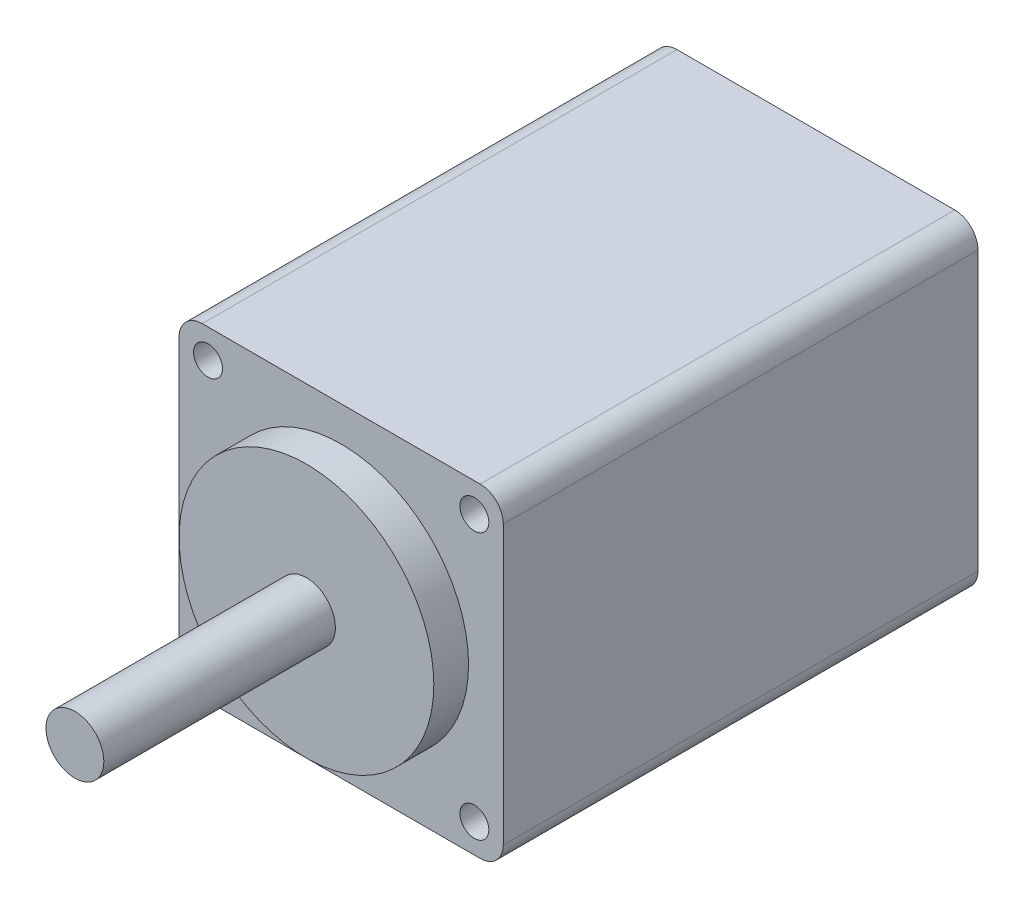
ISO-10303-21;
HEADER;
FILE_DESCRIPTION(('STEP AP214'),'2;1');
FILE_NAME('part.step','',(''),(''),'','','');
FILE_SCHEMA(('AUTOMOTIVE_DESIGN { 1 0 10303 214 1 1 1 1 }'));
ENDSEC;
DATA;
#1=APPLICATION_CONTEXT('core data for automotive mechanical design processes');
#2=APPLICATION_PROTOCOL_DEFINITION('international standard','automotive_design',2000,#1);
#3=PRODUCT_CONTEXT('',#1,'mechanical');
#4=PRODUCT('Part','Part','',(#3));
#5=PRODUCT_RELATED_PRODUCT_CATEGORY('part','',(#4));
#6=PRODUCT_DEFINITION_FORMATION('','',#4);
#7=PRODUCT_DEFINITION_CONTEXT('part definition',#1,'design');
#8=PRODUCT_DEFINITION('design','',#6,#7);
#9=PRODUCT_DEFINITION_SHAPE('','',#8);
#10=(LENGTH_UNIT() NAMED_UNIT(*) SI_UNIT(.MILLI.,.METRE.));
#11=(NAMED_UNIT(*) PLANE_ANGLE_UNIT() SI_UNIT($,.RADIAN.));
#12=(NAMED_UNIT(*) SI_UNIT($,.STERADIAN.) SOLID_ANGLE_UNIT());
#13=UNCERTAINTY_MEASURE_WITH_UNIT(LENGTH_MEASURE(1.E-05),#10,'distance_accuracy_value','');
#14=(GEOMETRIC_REPRESENTATION_CONTEXT(3) GLOBAL_UNCERTAINTY_ASSIGNED_CONTEXT((#13)) GLOBAL_UNIT_ASSIGNED_CONTEXT((#10,
#11,#12)) REPRESENTATION_CONTEXT('',''));
#15=CARTESIAN_POINT('',(0.,0.,0.));
#16=DIRECTION('',(0.,0.,1.));
#17=DIRECTION('',(1.,0.,0.));
#18=AXIS2_PLACEMENT_3D('',#15,#16,#17);
#19=CARTESIAN_POINT('',(0.,0.,41.));
#20=DIRECTION('',(0.,0.,1.));
#21=DIRECTION('',(1.,0.,0.));
#22=AXIS2_PLACEMENT_3D('',#19,#20,#21);
#23=PLANE('',#22);
#24=CARTESIAN_POINT('',(0.,0.,41.));
#25=DIRECTION('',(0.,0.,1.));
#26=DIRECTION('',(1.,0.,0.));
#27=AXIS2_PLACEMENT_3D('',#24,#25,#26);
#28=CIRCLE('',#27,11.);
#29=CARTESIAN_POINT('',(11.,0.,41.));
#30=VERTEX_POINT('',#29);
#31=EDGE_CURVE('E203',#30,#30,#28,.T.);
#32=ORIENTED_EDGE('',*,*,#31,.F.);
#33=EDGE_LOOP('',(#32));
#34=FACE_BOUND('',#33,.T.);
#35=CARTESIAN_POINT('',(11.5,-11.5,41.));
#36=DIRECTION('',(0.,0.,1.));
#37=DIRECTION('',(1.,0.,0.));
#38=AXIS2_PLACEMENT_3D('',#35,#36,#37);
#39=CIRCLE('',#38,1.25);
#40=CARTESIAN_POINT('',(12.75,-11.5,41.));
#41=VERTEX_POINT('',#40);
#42=EDGE_CURVE('E188',#41,#41,#39,.T.);
#43=ORIENTED_EDGE('',*,*,#42,.F.);
#44=EDGE_LOOP('',(#43));
#45=FACE_BOUND('',#44,.T.);
#46=CARTESIAN_POINT('',(-11.5,11.5,41.));
#47=DIRECTION('',(0.,0.,1.));
#48=DIRECTION('',(1.,0.,0.));
#49=AXIS2_PLACEMENT_3D('',#46,#47,#48);
#50=CIRCLE('',#49,1.25);
#51=CARTESIAN_POINT('',(-10.25,11.5,41.));
#52=VERTEX_POINT('',#51);
#53=EDGE_CURVE('E171',#52,#52,#50,.T.);
#54=ORIENTED_EDGE('',*,*,#53,.F.);
#55=EDGE_LOOP('',(#54));
#56=FACE_BOUND('',#55,.T.);
#57=DIRECTION('',(0.,-1.,0.));
#58=VECTOR('',#57,1.);
#59=CARTESIAN_POINT('',(-14.,14.,41.));
#60=LINE('',#59,#58);
#61=CARTESIAN_POINT('',(-14.,12.,41.));
#62=VERTEX_POINT('',#61);
#63=CARTESIAN_POINT('',(-14.,-12.,41.));
#64=VERTEX_POINT('',#63);
#65=EDGE_CURVE('E178',#62,#64,#60,.T.);
#66=ORIENTED_EDGE('',*,*,#65,.T.);
#67=CARTESIAN_POINT('',(-12.,-12.,41.));
#68=DIRECTION('',(0.,0.,1.));
#69=DIRECTION('',(1.,0.,0.));
#70=AXIS2_PLACEMENT_3D('',#67,#68,#69);
#71=CIRCLE('',#70,2.);
#72=CARTESIAN_POINT('',(-12.,-14.,41.));
#73=VERTEX_POINT('',#72);
#74=EDGE_CURVE('E155',#64,#73,#71,.T.);
#75=ORIENTED_EDGE('',*,*,#74,.T.);
#76=DIRECTION('',(1.,0.,0.));
#77=VECTOR('',#76,1.);
#78=CARTESIAN_POINT('',(-14.,-14.,41.));
#79=LINE('',#78,#77);
#80=CARTESIAN_POINT('',(12.,-14.,41.));
#81=VERTEX_POINT('',#80);
#82=EDGE_CURVE('E125',#73,#81,#79,.T.);
#83=ORIENTED_EDGE('',*,*,#82,.T.);
#84=CARTESIAN_POINT('',(12.,-12.,41.));
#85=DIRECTION('',(0.,0.,1.));
#86=DIRECTION('',(1.,0.,0.));
#87=AXIS2_PLACEMENT_3D('',#84,#85,#86);
#88=CIRCLE('',#87,2.);
#89=CARTESIAN_POINT('',(14.,-12.,41.));
#90=VERTEX_POINT('',#89);
#91=EDGE_CURVE('E153',#81,#90,#88,.T.);
#92=ORIENTED_EDGE('',*,*,#91,.T.);
#93=DIRECTION('',(0.,1.,0.));
#94=VECTOR('',#93,1.);
#95=CARTESIAN_POINT('',(14.,14.,41.));
#96=LINE('',#95,#94);
#97=CARTESIAN_POINT('',(14.,12.,41.));
#98=VERTEX_POINT('',#97);
#99=EDGE_CURVE('E132',#90,#98,#96,.T.);
#100=ORIENTED_EDGE('',*,*,#99,.T.);
#101=CARTESIAN_POINT('',(12.,12.,41.));
#102=DIRECTION('',(0.,0.,1.));
#103=DIRECTION('',(1.,0.,0.));
#104=AXIS2_PLACEMENT_3D('',#101,#102,#103);
#105=CIRCLE('',#104,2.);
#106=CARTESIAN_POINT('',(12.,14.,41.));
#107=VERTEX_POINT('',#106);
#108=EDGE_CURVE('E60',#98,#107,#105,.T.);
#109=ORIENTED_EDGE('',*,*,#108,.T.);
#110=DIRECTION('',(-1.,0.,0.));
#111=VECTOR('',#110,1.);
#112=CARTESIAN_POINT('',(-14.,14.,41.));
#113=LINE('',#112,#111);
#114=CARTESIAN_POINT('',(-12.,14.,41.));
#115=VERTEX_POINT('',#114);
#116=EDGE_CURVE('E135',#107,#115,#113,.T.);
#117=ORIENTED_EDGE('',*,*,#116,.T.);
#118=CARTESIAN_POINT('',(-12.,12.,41.));
#119=DIRECTION('',(0.,0.,1.));
#120=DIRECTION('',(1.,0.,0.));
#121=AXIS2_PLACEMENT_3D('',#118,#119,#120);
#122=CIRCLE('',#121,2.);
#123=EDGE_CURVE('E150',#115,#62,#122,.T.);
#124=ORIENTED_EDGE('',*,*,#123,.T.);
#125=EDGE_LOOP('',(#66,#75,#83,#92,#100,#109,#117,#124));
#126=FACE_BOUND('',#125,.T.);
#127=CARTESIAN_POINT('',(11.5,11.5,41.));
#128=DIRECTION('',(0.,0.,1.));
#129=DIRECTION('',(-1.,0.,0.));
#130=AXIS2_PLACEMENT_3D('',#127,#128,#129);
#131=CIRCLE('',#130,1.25);
#132=CARTESIAN_POINT('',(10.25,11.5,41.));
#133=VERTEX_POINT('',#132);
#134=EDGE_CURVE('E183',#133,#133,#131,.T.);
#135=ORIENTED_EDGE('',*,*,#134,.F.);
#136=EDGE_LOOP('',(#135));
#137=FACE_BOUND('',#136,.T.);
#138=CARTESIAN_POINT('',(-11.5,-11.5,41.));
#139=DIRECTION('',(0.,0.,1.));
#140=DIRECTION('',(-1.,0.,0.));
#141=AXIS2_PLACEMENT_3D('',#138,#139,#140);
#142=CIRCLE('',#141,1.25);
#143=CARTESIAN_POINT('',(-12.75,-11.5,41.));
#144=VERTEX_POINT('',#143);
#145=EDGE_CURVE('E194',#144,#144,#142,.T.);
#146=ORIENTED_EDGE('',*,*,#145,.F.);
#147=EDGE_LOOP('',(#146));
#148=FACE_BOUND('',#147,.T.);
#149=ADVANCED_FACE('F39',(#34,#45,#56,#126,#137,#148),#23,.T.);
#150=CARTESIAN_POINT('',(0.,0.,0.));
#151=DIRECTION('',(0.,0.,1.));
#152=DIRECTION('',(1.,0.,0.));
#153=AXIS2_PLACEMENT_3D('',#150,#151,#152);
#154=PLANE('',#153);
#155=DIRECTION('',(1.,0.,0.));
#156=VECTOR('',#155,1.);
#157=CARTESIAN_POINT('',(-14.,-14.,0.));
#158=LINE('',#157,#156);
#159=CARTESIAN_POINT('',(-12.,-14.,0.));
#160=VERTEX_POINT('',#159);
#161=CARTESIAN_POINT('',(12.,-14.,0.));
#162=VERTEX_POINT('',#161);
#163=EDGE_CURVE('E122',#160,#162,#158,.T.);
#164=ORIENTED_EDGE('',*,*,#163,.F.);
#165=CARTESIAN_POINT('',(-12.,-12.,0.));
#166=DIRECTION('',(0.,0.,1.));
#167=DIRECTION('',(1.,0.,0.));
#168=AXIS2_PLACEMENT_3D('',#165,#166,#167);
#169=CIRCLE('',#168,2.);
#170=CARTESIAN_POINT('',(-14.,-12.,0.));
#171=VERTEX_POINT('',#170);
#172=EDGE_CURVE('E105',#160,#171,#169,.F.);
#173=ORIENTED_EDGE('',*,*,#172,.T.);
#174=DIRECTION('',(0.,-1.,0.));
#175=VECTOR('',#174,1.);
#176=CARTESIAN_POINT('',(-14.,14.,0.));
#177=LINE('',#176,#175);
#178=CARTESIAN_POINT('',(-14.,12.,0.));
#179=VERTEX_POINT('',#178);
#180=EDGE_CURVE('E133',#179,#171,#177,.T.);
#181=ORIENTED_EDGE('',*,*,#180,.F.);
#182=CARTESIAN_POINT('',(-12.,12.,0.));
#183=DIRECTION('',(0.,0.,1.));
#184=DIRECTION('',(1.,0.,0.));
#185=AXIS2_PLACEMENT_3D('',#182,#183,#184);
#186=CIRCLE('',#185,2.);
#187=CARTESIAN_POINT('',(-12.,14.,0.));
#188=VERTEX_POINT('',#187);
#189=EDGE_CURVE('E126',#179,#188,#186,.F.);
#190=ORIENTED_EDGE('',*,*,#189,.T.);
#191=DIRECTION('',(-1.,0.,0.));
#192=VECTOR('',#191,1.);
#193=CARTESIAN_POINT('',(-14.,14.,0.));
#194=LINE('',#193,#192);
#195=CARTESIAN_POINT('',(12.,14.,0.));
#196=VERTEX_POINT('',#195);
#197=EDGE_CURVE('E137',#196,#188,#194,.T.);
#198=ORIENTED_EDGE('',*,*,#197,.F.);
#199=CARTESIAN_POINT('',(12.,12.,0.));
#200=DIRECTION('',(0.,0.,1.));
#201=DIRECTION('',(1.,0.,0.));
#202=AXIS2_PLACEMENT_3D('',#199,#200,#201);
#203=CIRCLE('',#202,2.);
#204=CARTESIAN_POINT('',(14.,12.,0.));
#205=VERTEX_POINT('',#204);
#206=EDGE_CURVE('E144',#196,#205,#203,.F.);
#207=ORIENTED_EDGE('',*,*,#206,.T.);
#208=DIRECTION('',(0.,1.,0.));
#209=VECTOR('',#208,1.);
#210=CARTESIAN_POINT('',(14.,14.,0.));
#211=LINE('',#210,#209);
#212=CARTESIAN_POINT('',(14.,-12.,0.));
#213=VERTEX_POINT('',#212);
#214=EDGE_CURVE('E166',#213,#205,#211,.T.);
#215=ORIENTED_EDGE('',*,*,#214,.F.);
#216=CARTESIAN_POINT('',(12.,-12.,0.));
#217=DIRECTION('',(0.,0.,1.));
#218=DIRECTION('',(1.,0.,0.));
#219=AXIS2_PLACEMENT_3D('',#216,#217,#218);
#220=CIRCLE('',#219,2.);
#221=EDGE_CURVE('E116',#213,#162,#220,.F.);
#222=ORIENTED_EDGE('',*,*,#221,.T.);
#223=EDGE_LOOP('',(#164,#173,#181,#190,#198,#207,#215,#222));
#224=FACE_BOUND('',#223,.T.);
#225=CARTESIAN_POINT('',(-11.5,11.5,0.));
#226=DIRECTION('',(0.,0.,1.));
#227=DIRECTION('',(1.,0.,0.));
#228=AXIS2_PLACEMENT_3D('',#225,#226,#227);
#229=CIRCLE('',#228,1.25);
#230=CARTESIAN_POINT('',(-10.25,11.5,0.));
#231=VERTEX_POINT('',#230);
#232=EDGE_CURVE('E174',#231,#231,#229,.T.);
#233=ORIENTED_EDGE('',*,*,#232,.T.);
#234=EDGE_LOOP('',(#233));
#235=FACE_BOUND('',#234,.T.);
#236=CARTESIAN_POINT('',(11.5,11.5,0.));
#237=DIRECTION('',(0.,0.,1.));
#238=DIRECTION('',(-1.,0.,0.));
#239=AXIS2_PLACEMENT_3D('',#236,#237,#238);
#240=CIRCLE('',#239,1.25);
#241=CARTESIAN_POINT('',(10.25,11.5,0.));
#242=VERTEX_POINT('',#241);
#243=EDGE_CURVE('E185',#242,#242,#240,.T.);
#244=ORIENTED_EDGE('',*,*,#243,.T.);
#245=EDGE_LOOP('',(#244));
#246=FACE_BOUND('',#245,.T.);
#247=CARTESIAN_POINT('',(11.5,-11.5,0.));
#248=DIRECTION('',(0.,0.,1.));
#249=DIRECTION('',(1.,0.,0.));
#250=AXIS2_PLACEMENT_3D('',#247,#248,#249);
#251=CIRCLE('',#250,1.25);
#252=CARTESIAN_POINT('',(12.75,-11.5,0.));
#253=VERTEX_POINT('',#252);
#254=EDGE_CURVE('E191',#253,#253,#251,.T.);
#255=ORIENTED_EDGE('',*,*,#254,.T.);
#256=EDGE_LOOP('',(#255));
#257=FACE_BOUND('',#256,.T.);
#258=CARTESIAN_POINT('',(-11.5,-11.5,0.));
#259=DIRECTION('',(0.,0.,1.));
#260=DIRECTION('',(-1.,0.,0.));
#261=AXIS2_PLACEMENT_3D('',#258,#259,#260);
#262=CIRCLE('',#261,1.25);
#263=CARTESIAN_POINT('',(-12.75,-11.5,0.));
#264=VERTEX_POINT('',#263);
#265=EDGE_CURVE('E197',#264,#264,#262,.T.);
#266=ORIENTED_EDGE('',*,*,#265,.T.);
#267=EDGE_LOOP('',(#266));
#268=FACE_BOUND('',#267,.T.);
#269=ADVANCED_FACE('F129',(#224,#235,#246,#257,#268),#154,.F.);
#270=CARTESIAN_POINT('',(14.,14.,41.));
#271=DIRECTION('',(-1.,0.,0.));
#272=DIRECTION('',(0.,0.,1.));
#273=AXIS2_PLACEMENT_3D('',#270,#271,#272);
#274=PLANE('',#273);
#275=ORIENTED_EDGE('',*,*,#99,.F.);
#276=DIRECTION('',(0.,0.,-1.));
#277=VECTOR('',#276,1.);
#278=CARTESIAN_POINT('',(14.,-12.,41.));
#279=LINE('',#278,#277);
#280=EDGE_CURVE('E159',#90,#213,#279,.T.);
#281=ORIENTED_EDGE('',*,*,#280,.T.);
#282=ORIENTED_EDGE('',*,*,#214,.T.);
#283=DIRECTION('',(0.,0.,-1.));
#284=VECTOR('',#283,1.);
#285=CARTESIAN_POINT('',(14.,12.,41.));
#286=LINE('',#285,#284);
#287=EDGE_CURVE('E157',#205,#98,#286,.F.);
#288=ORIENTED_EDGE('',*,*,#287,.T.);
#289=EDGE_LOOP('',(#275,#281,#282,#288));
#290=FACE_BOUND('',#289,.T.);
#291=ADVANCED_FACE('F165',(#290),#274,.F.);
#292=CARTESIAN_POINT('',(-14.,14.,41.));
#293=DIRECTION('',(0.,-1.,0.));
#294=DIRECTION('',(0.,0.,-1.));
#295=AXIS2_PLACEMENT_3D('',#292,#293,#294);
#296=PLANE('',#295);
#297=ORIENTED_EDGE('',*,*,#116,.F.);
#298=DIRECTION('',(0.,0.,-1.));
#299=VECTOR('',#298,1.);
#300=CARTESIAN_POINT('',(12.,14.,41.));
#301=LINE('',#300,#299);
#302=EDGE_CURVE('E11',#107,#196,#301,.T.);
#303=ORIENTED_EDGE('',*,*,#302,.T.);
#304=ORIENTED_EDGE('',*,*,#197,.T.);
#305=DIRECTION('',(0.,0.,-1.));
#306=VECTOR('',#305,1.);
#307=CARTESIAN_POINT('',(-12.,14.,41.));
#308=LINE('',#307,#306);
#309=EDGE_CURVE('E47',#188,#115,#308,.F.);
#310=ORIENTED_EDGE('',*,*,#309,.T.);
#311=EDGE_LOOP('',(#297,#303,#304,#310));
#312=FACE_BOUND('',#311,.T.);
#313=ADVANCED_FACE('F258',(#312),#296,.F.);
#314=CARTESIAN_POINT('',(-14.,14.,41.));
#315=DIRECTION('',(1.,0.,0.));
#316=DIRECTION('',(0.,0.,-1.));
#317=AXIS2_PLACEMENT_3D('',#314,#315,#316);
#318=PLANE('',#317);
#319=ORIENTED_EDGE('',*,*,#180,.T.);
#320=DIRECTION('',(0.,0.,-1.));
#321=VECTOR('',#320,1.);
#322=CARTESIAN_POINT('',(-14.,-12.,41.));
#323=LINE('',#322,#321);
#324=EDGE_CURVE('E110',#171,#64,#323,.F.);
#325=ORIENTED_EDGE('',*,*,#324,.T.);
#326=ORIENTED_EDGE('',*,*,#65,.F.);
#327=DIRECTION('',(0.,0.,-1.));
#328=VECTOR('',#327,1.);
#329=CARTESIAN_POINT('',(-14.,12.,41.));
#330=LINE('',#329,#328);
#331=EDGE_CURVE('E115',#62,#179,#330,.T.);
#332=ORIENTED_EDGE('',*,*,#331,.T.);
#333=EDGE_LOOP('',(#319,#325,#326,#332));
#334=FACE_BOUND('',#333,.T.);
#335=ADVANCED_FACE('F265',(#334),#318,.F.);
#336=CARTESIAN_POINT('',(-14.,-14.,41.));
#337=DIRECTION('',(0.,1.,0.));
#338=DIRECTION('',(0.,0.,1.));
#339=AXIS2_PLACEMENT_3D('',#336,#337,#338);
#340=PLANE('',#339);
#341=ORIENTED_EDGE('',*,*,#82,.F.);
#342=DIRECTION('',(0.,0.,-1.));
#343=VECTOR('',#342,1.);
#344=CARTESIAN_POINT('',(-12.,-14.,41.));
#345=LINE('',#344,#343);
#346=EDGE_CURVE('E109',#73,#160,#345,.T.);
#347=ORIENTED_EDGE('',*,*,#346,.T.);
#348=ORIENTED_EDGE('',*,*,#163,.T.);
#349=DIRECTION('',(0.,0.,-1.));
#350=VECTOR('',#349,1.);
#351=CARTESIAN_POINT('',(12.,-14.,41.));
#352=LINE('',#351,#350);
#353=EDGE_CURVE('E127',#162,#81,#352,.F.);
#354=ORIENTED_EDGE('',*,*,#353,.T.);
#355=EDGE_LOOP('',(#341,#347,#348,#354));
#356=FACE_BOUND('',#355,.T.);
#357=ADVANCED_FACE('F121',(#356),#340,.F.);
#358=CARTESIAN_POINT('',(-11.5,11.5,41.));
#359=DIRECTION('',(0.,0.,-1.));
#360=DIRECTION('',(-1.,0.,0.));
#361=AXIS2_PLACEMENT_3D('',#358,#359,#360);
#362=CYLINDRICAL_SURFACE('',#361,1.25);
#363=ORIENTED_EDGE('',*,*,#53,.T.);
#364=EDGE_LOOP('',(#363));
#365=FACE_BOUND('',#364,.T.);
#366=ORIENTED_EDGE('',*,*,#232,.F.);
#367=EDGE_LOOP('',(#366));
#368=FACE_BOUND('',#367,.T.);
#369=ADVANCED_FACE('F264',(#365,#368),#362,.F.);
#370=CARTESIAN_POINT('',(11.5,11.5,41.));
#371=DIRECTION('',(0.,0.,-1.));
#372=DIRECTION('',(-1.,0.,0.));
#373=AXIS2_PLACEMENT_3D('',#370,#371,#372);
#374=CYLINDRICAL_SURFACE('',#373,1.25);
#375=ORIENTED_EDGE('',*,*,#134,.T.);
#376=EDGE_LOOP('',(#375));
#377=FACE_BOUND('',#376,.T.);
#378=ORIENTED_EDGE('',*,*,#243,.F.);
#379=EDGE_LOOP('',(#378));
#380=FACE_BOUND('',#379,.T.);
#381=ADVANCED_FACE('F395',(#377,#380),#374,.F.);
#382=CARTESIAN_POINT('',(11.5,-11.5,41.));
#383=DIRECTION('',(0.,0.,-1.));
#384=DIRECTION('',(-1.,0.,0.));
#385=AXIS2_PLACEMENT_3D('',#382,#383,#384);
#386=CYLINDRICAL_SURFACE('',#385,1.25);
#387=ORIENTED_EDGE('',*,*,#42,.T.);
#388=EDGE_LOOP('',(#387));
#389=FACE_BOUND('',#388,.T.);
#390=ORIENTED_EDGE('',*,*,#254,.F.);
#391=EDGE_LOOP('',(#390));
#392=FACE_BOUND('',#391,.T.);
#393=ADVANCED_FACE('F249',(#389,#392),#386,.F.);
#394=CARTESIAN_POINT('',(-11.5,-11.5,41.));
#395=DIRECTION('',(0.,0.,-1.));
#396=DIRECTION('',(-1.,0.,0.));
#397=AXIS2_PLACEMENT_3D('',#394,#395,#396);
#398=CYLINDRICAL_SURFACE('',#397,1.25);
#399=ORIENTED_EDGE('',*,*,#145,.T.);
#400=EDGE_LOOP('',(#399));
#401=FACE_BOUND('',#400,.T.);
#402=ORIENTED_EDGE('',*,*,#265,.F.);
#403=EDGE_LOOP('',(#402));
#404=FACE_BOUND('',#403,.T.);
#405=ADVANCED_FACE('F231',(#401,#404),#398,.F.);
#406=CARTESIAN_POINT('',(0.,0.,44.));
#407=DIRECTION('',(0.,0.,-1.));
#408=DIRECTION('',(-1.,0.,0.));
#409=AXIS2_PLACEMENT_3D('',#406,#407,#408);
#410=CYLINDRICAL_SURFACE('',#409,11.);
#411=CARTESIAN_POINT('',(0.,0.,44.));
#412=DIRECTION('',(0.,0.,1.));
#413=DIRECTION('',(1.,0.,0.));
#414=AXIS2_PLACEMENT_3D('',#411,#412,#413);
#415=CIRCLE('',#414,11.);
#416=CARTESIAN_POINT('',(11.,0.,44.));
#417=VERTEX_POINT('',#416);
#418=EDGE_CURVE('E200',#417,#417,#415,.T.);
#419=ORIENTED_EDGE('',*,*,#418,.F.);
#420=EDGE_LOOP('',(#419));
#421=FACE_BOUND('',#420,.T.);
#422=ORIENTED_EDGE('',*,*,#31,.T.);
#423=EDGE_LOOP('',(#422));
#424=FACE_BOUND('',#423,.T.);
#425=ADVANCED_FACE('F225',(#421,#424),#410,.T.);
#426=CARTESIAN_POINT('',(0.,0.,44.));
#427=DIRECTION('',(0.,0.,1.));
#428=DIRECTION('',(1.,0.,0.));
#429=AXIS2_PLACEMENT_3D('',#426,#427,#428);
#430=PLANE('',#429);
#431=CARTESIAN_POINT('',(0.,0.,44.));
#432=DIRECTION('',(0.,0.,1.));
#433=DIRECTION('',(1.,0.,0.));
#434=AXIS2_PLACEMENT_3D('',#431,#432,#433);
#435=CIRCLE('',#434,2.5);
#436=CARTESIAN_POINT('',(2.5,0.,44.));
#437=VERTEX_POINT('',#436);
#438=EDGE_CURVE('E141',#437,#437,#435,.T.);
#439=ORIENTED_EDGE('',*,*,#438,.F.);
#440=EDGE_LOOP('',(#439));
#441=FACE_BOUND('',#440,.T.);
#442=ORIENTED_EDGE('',*,*,#418,.T.);
#443=EDGE_LOOP('',(#442));
#444=FACE_BOUND('',#443,.T.);
#445=ADVANCED_FACE('F219',(#441,#444),#430,.T.);
#446=CARTESIAN_POINT('',(0.,0.,64.));
#447=DIRECTION('',(0.,0.,-1.));
#448=DIRECTION('',(-1.,0.,0.));
#449=AXIS2_PLACEMENT_3D('',#446,#447,#448);
#450=CYLINDRICAL_SURFACE('',#449,2.5);
#451=CARTESIAN_POINT('',(0.,0.,64.));
#452=DIRECTION('',(0.,0.,1.));
#453=DIRECTION('',(1.,0.,0.));
#454=AXIS2_PLACEMENT_3D('',#451,#452,#453);
#455=CIRCLE('',#454,2.5);
#456=CARTESIAN_POINT('',(2.5,0.,64.));
#457=VERTEX_POINT('',#456);
#458=EDGE_CURVE('E206',#457,#457,#455,.T.);
#459=ORIENTED_EDGE('',*,*,#458,.F.);
#460=EDGE_LOOP('',(#459));
#461=FACE_BOUND('',#460,.T.);
#462=ORIENTED_EDGE('',*,*,#438,.T.);
#463=EDGE_LOOP('',(#462));
#464=FACE_BOUND('',#463,.T.);
#465=ADVANCED_FACE('F216',(#461,#464),#450,.T.);
#466=CARTESIAN_POINT('',(0.,0.,64.));
#467=DIRECTION('',(0.,0.,1.));
#468=DIRECTION('',(1.,0.,0.));
#469=AXIS2_PLACEMENT_3D('',#466,#467,#468);
#470=PLANE('',#469);
#471=ORIENTED_EDGE('',*,*,#458,.T.);
#472=EDGE_LOOP('',(#471));
#473=FACE_BOUND('',#472,.T.);
#474=ADVANCED_FACE('F214',(#473),#470,.T.);
#475=CARTESIAN_POINT('',(-12.,-12.,41.));
#476=DIRECTION('',(0.,0.,-1.));
#477=DIRECTION('',(-1.,0.,0.));
#478=AXIS2_PLACEMENT_3D('',#475,#476,#477);
#479=CYLINDRICAL_SURFACE('',#478,2.);
#480=ORIENTED_EDGE('',*,*,#74,.F.);
#481=ORIENTED_EDGE('',*,*,#324,.F.);
#482=ORIENTED_EDGE('',*,*,#172,.F.);
#483=ORIENTED_EDGE('',*,*,#346,.F.);
#484=EDGE_LOOP('',(#480,#481,#482,#483));
#485=FACE_BOUND('',#484,.T.);
#486=ADVANCED_FACE('F108',(#485),#479,.T.);
#487=CARTESIAN_POINT('',(12.,-12.,41.));
#488=DIRECTION('',(0.,0.,-1.));
#489=DIRECTION('',(-1.,0.,0.));
#490=AXIS2_PLACEMENT_3D('',#487,#488,#489);
#491=CYLINDRICAL_SURFACE('',#490,2.);
#492=ORIENTED_EDGE('',*,*,#91,.F.);
#493=ORIENTED_EDGE('',*,*,#353,.F.);
#494=ORIENTED_EDGE('',*,*,#221,.F.);
#495=ORIENTED_EDGE('',*,*,#280,.F.);
#496=EDGE_LOOP('',(#492,#493,#494,#495));
#497=FACE_BOUND('',#496,.T.);
#498=ADVANCED_FACE('F273',(#497),#491,.T.);
#499=CARTESIAN_POINT('',(12.,12.,41.));
#500=DIRECTION('',(0.,0.,-1.));
#501=DIRECTION('',(-1.,0.,0.));
#502=AXIS2_PLACEMENT_3D('',#499,#500,#501);
#503=CYLINDRICAL_SURFACE('',#502,2.);
#504=ORIENTED_EDGE('',*,*,#108,.F.);
#505=ORIENTED_EDGE('',*,*,#287,.F.);
#506=ORIENTED_EDGE('',*,*,#206,.F.);
#507=ORIENTED_EDGE('',*,*,#302,.F.);
#508=EDGE_LOOP('',(#504,#505,#506,#507));
#509=FACE_BOUND('',#508,.T.);
#510=ADVANCED_FACE('F275',(#509),#503,.T.);
#511=CARTESIAN_POINT('',(-12.,12.,41.));
#512=DIRECTION('',(0.,0.,-1.));
#513=DIRECTION('',(-1.,0.,0.));
#514=AXIS2_PLACEMENT_3D('',#511,#512,#513);
#515=CYLINDRICAL_SURFACE('',#514,2.);
#516=ORIENTED_EDGE('',*,*,#123,.F.);
#517=ORIENTED_EDGE('',*,*,#309,.F.);
#518=ORIENTED_EDGE('',*,*,#189,.F.);
#519=ORIENTED_EDGE('',*,*,#331,.F.);
#520=EDGE_LOOP('',(#516,#517,#518,#519));
#521=FACE_BOUND('',#520,.T.);
#522=ADVANCED_FACE('F41',(#521),#515,.T.);
#523=CLOSED_SHELL('',(#149,#269,#291,#313,#335,#357,#369,#381,#393,#405,#425,#445,#465,#474,
#486,#498,#510,#522));
#524=MANIFOLD_SOLID_BREP('B2',#523);
#525=ADVANCED_BREP_SHAPE_REPRESENTATION('',(#18,#524),#14);
#526=SHAPE_DEFINITION_REPRESENTATION(#9,#525);
ENDSEC;
END-ISO-10303-21;
